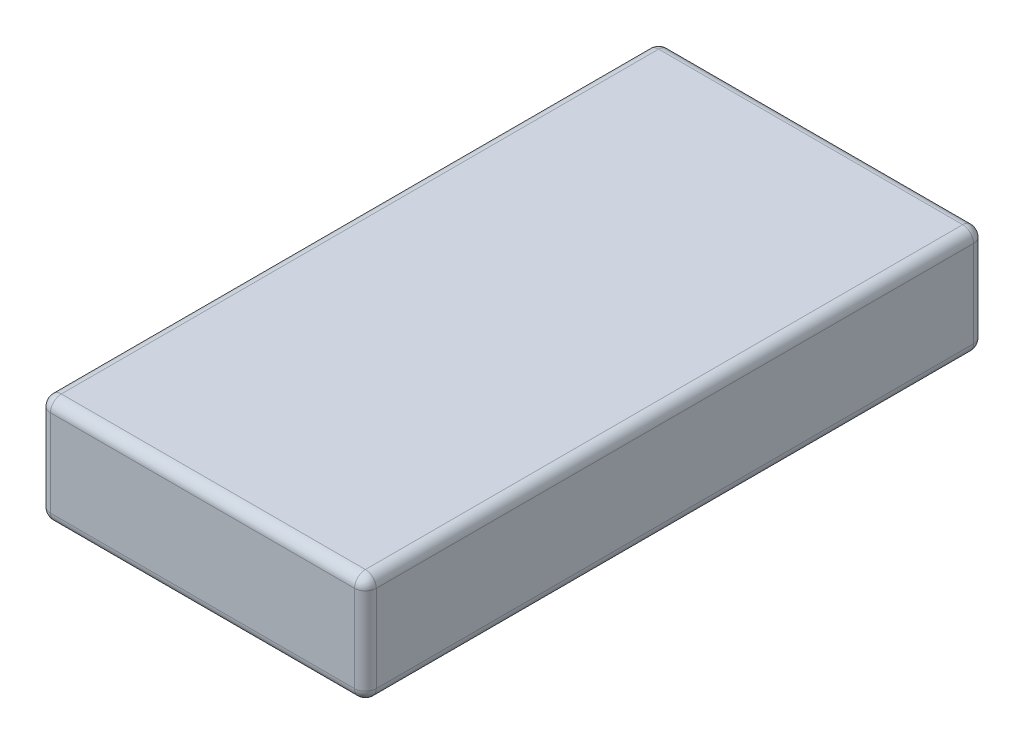
ISO-10303-21;
HEADER;
FILE_DESCRIPTION(('STEP AP214'),'2;1');
FILE_NAME('part.step','',(''),(''),'','','');
FILE_SCHEMA(('AUTOMOTIVE_DESIGN { 1 0 10303 214 1 1 1 1 }'));
ENDSEC;
DATA;
#1=APPLICATION_CONTEXT('core data for automotive mechanical design processes');
#2=APPLICATION_PROTOCOL_DEFINITION('international standard','automotive_design',2000,#1);
#3=PRODUCT_CONTEXT('',#1,'mechanical');
#4=PRODUCT('Part','Part','',(#3));
#5=PRODUCT_RELATED_PRODUCT_CATEGORY('part','',(#4));
#6=PRODUCT_DEFINITION_FORMATION('','',#4);
#7=PRODUCT_DEFINITION_CONTEXT('part definition',#1,'design');
#8=PRODUCT_DEFINITION('design','',#6,#7);
#9=PRODUCT_DEFINITION_SHAPE('','',#8);
#10=(LENGTH_UNIT() NAMED_UNIT(*) SI_UNIT(.MILLI.,.METRE.));
#11=(NAMED_UNIT(*) PLANE_ANGLE_UNIT() SI_UNIT($,.RADIAN.));
#12=(NAMED_UNIT(*) SI_UNIT($,.STERADIAN.) SOLID_ANGLE_UNIT());
#13=UNCERTAINTY_MEASURE_WITH_UNIT(LENGTH_MEASURE(1.E-05),#10,'distance_accuracy_value','');
#14=(GEOMETRIC_REPRESENTATION_CONTEXT(3) GLOBAL_UNCERTAINTY_ASSIGNED_CONTEXT((#13)) GLOBAL_UNIT_ASSIGNED_CONTEXT((#10,
#11,#12)) REPRESENTATION_CONTEXT('',''));
#15=CARTESIAN_POINT('',(0.,0.,0.));
#16=DIRECTION('',(0.,0.,1.));
#17=DIRECTION('',(1.,0.,0.));
#18=AXIS2_PLACEMENT_3D('',#15,#16,#17);
#19=CARTESIAN_POINT('',(15.,5.,57.));
#20=DIRECTION('',(-1.,0.,0.));
#21=DIRECTION('',(0.,-1.,0.));
#22=AXIS2_PLACEMENT_3D('',#19,#20,#21);
#23=PLANE('',#22);
#24=DIRECTION('',(0.,0.,-1.));
#25=VECTOR('',#24,1.);
#26=CARTESIAN_POINT('',(15.,-4.,57.));
#27=LINE('',#26,#25);
#28=CARTESIAN_POINT('',(15.,-4.,56.));
#29=VERTEX_POINT('',#28);
#30=CARTESIAN_POINT('',(15.,-4.,1.));
#31=VERTEX_POINT('',#30);
#32=EDGE_CURVE('E183',#29,#31,#27,.T.);
#33=ORIENTED_EDGE('',*,*,#32,.T.);
#34=DIRECTION('',(0.,1.,0.));
#35=VECTOR('',#34,1.);
#36=CARTESIAN_POINT('',(15.,5.,1.));
#37=LINE('',#36,#35);
#38=CARTESIAN_POINT('',(15.,4.,1.));
#39=VERTEX_POINT('',#38);
#40=EDGE_CURVE('E187',#31,#39,#37,.T.);
#41=ORIENTED_EDGE('',*,*,#40,.T.);
#42=DIRECTION('',(0.,0.,-1.));
#43=VECTOR('',#42,1.);
#44=CARTESIAN_POINT('',(15.,4.,57.));
#45=LINE('',#44,#43);
#46=CARTESIAN_POINT('',(15.,4.,56.));
#47=VERTEX_POINT('',#46);
#48=EDGE_CURVE('E185',#39,#47,#45,.F.);
#49=ORIENTED_EDGE('',*,*,#48,.T.);
#50=DIRECTION('',(0.,1.,0.));
#51=VECTOR('',#50,1.);
#52=CARTESIAN_POINT('',(15.,-5.,56.));
#53=LINE('',#52,#51);
#54=EDGE_CURVE('E181',#47,#29,#53,.F.);
#55=ORIENTED_EDGE('',*,*,#54,.T.);
#56=EDGE_LOOP('',(#33,#41,#49,#55));
#57=FACE_BOUND('',#56,.T.);
#58=ADVANCED_FACE('F35',(#57),#23,.F.);
#59=CARTESIAN_POINT('',(-15.,5.,57.));
#60=DIRECTION('',(0.,-1.,0.));
#61=DIRECTION('',(0.,0.,-1.));
#62=AXIS2_PLACEMENT_3D('',#59,#60,#61);
#63=PLANE('',#62);
#64=DIRECTION('',(-1.,0.,0.));
#65=VECTOR('',#64,1.);
#66=CARTESIAN_POINT('',(-15.,5.,1.));
#67=LINE('',#66,#65);
#68=CARTESIAN_POINT('',(14.,5.,1.));
#69=VERTEX_POINT('',#68);
#70=CARTESIAN_POINT('',(-14.,5.,1.));
#71=VERTEX_POINT('',#70);
#72=EDGE_CURVE('E169',#69,#71,#67,.T.);
#73=ORIENTED_EDGE('',*,*,#72,.T.);
#74=DIRECTION('',(0.,0.,-1.));
#75=VECTOR('',#74,1.);
#76=CARTESIAN_POINT('',(-14.,5.,57.));
#77=LINE('',#76,#75);
#78=CARTESIAN_POINT('',(-14.,5.,56.));
#79=VERTEX_POINT('',#78);
#80=EDGE_CURVE('E134',#71,#79,#77,.F.);
#81=ORIENTED_EDGE('',*,*,#80,.T.);
#82=DIRECTION('',(-1.,0.,0.));
#83=VECTOR('',#82,1.);
#84=CARTESIAN_POINT('',(15.,5.,56.));
#85=LINE('',#84,#83);
#86=CARTESIAN_POINT('',(14.,5.,56.));
#87=VERTEX_POINT('',#86);
#88=EDGE_CURVE('E161',#79,#87,#85,.F.);
#89=ORIENTED_EDGE('',*,*,#88,.T.);
#90=DIRECTION('',(0.,0.,-1.));
#91=VECTOR('',#90,1.);
#92=CARTESIAN_POINT('',(14.,5.,57.));
#93=LINE('',#92,#91);
#94=EDGE_CURVE('E163',#87,#69,#93,.T.);
#95=ORIENTED_EDGE('',*,*,#94,.T.);
#96=EDGE_LOOP('',(#73,#81,#89,#95));
#97=FACE_BOUND('',#96,.T.);
#98=ADVANCED_FACE('F317',(#97),#63,.F.);
#99=CARTESIAN_POINT('',(-15.,5.,57.));
#100=DIRECTION('',(1.,0.,0.));
#101=DIRECTION('',(0.,0.,-1.));
#102=AXIS2_PLACEMENT_3D('',#99,#100,#101);
#103=PLANE('',#102);
#104=DIRECTION('',(0.,-1.,0.));
#105=VECTOR('',#104,1.);
#106=CARTESIAN_POINT('',(-15.,5.,56.));
#107=LINE('',#106,#105);
#108=CARTESIAN_POINT('',(-15.,-4.,56.));
#109=VERTEX_POINT('',#108);
#110=CARTESIAN_POINT('',(-15.,4.,56.));
#111=VERTEX_POINT('',#110);
#112=EDGE_CURVE('E159',#109,#111,#107,.F.);
#113=ORIENTED_EDGE('',*,*,#112,.T.);
#114=DIRECTION('',(0.,0.,-1.));
#115=VECTOR('',#114,1.);
#116=CARTESIAN_POINT('',(-15.,4.,57.));
#117=LINE('',#116,#115);
#118=CARTESIAN_POINT('',(-15.,4.,1.));
#119=VERTEX_POINT('',#118);
#120=EDGE_CURVE('E132',#111,#119,#117,.T.);
#121=ORIENTED_EDGE('',*,*,#120,.T.);
#122=DIRECTION('',(0.,-1.,0.));
#123=VECTOR('',#122,1.);
#124=CARTESIAN_POINT('',(-15.,5.,1.));
#125=LINE('',#124,#123);
#126=CARTESIAN_POINT('',(-15.,-4.,1.));
#127=VERTEX_POINT('',#126);
#128=EDGE_CURVE('E150',#119,#127,#125,.T.);
#129=ORIENTED_EDGE('',*,*,#128,.T.);
#130=DIRECTION('',(0.,0.,-1.));
#131=VECTOR('',#130,1.);
#132=CARTESIAN_POINT('',(-15.,-4.,57.));
#133=LINE('',#132,#131);
#134=EDGE_CURVE('E155',#127,#109,#133,.F.);
#135=ORIENTED_EDGE('',*,*,#134,.T.);
#136=EDGE_LOOP('',(#113,#121,#129,#135));
#137=FACE_BOUND('',#136,.T.);
#138=ADVANCED_FACE('F157',(#137),#103,.F.);
#139=CARTESIAN_POINT('',(-15.,-5.,57.));
#140=DIRECTION('',(0.,1.,0.));
#141=DIRECTION('',(0.,0.,1.));
#142=AXIS2_PLACEMENT_3D('',#139,#140,#141);
#143=PLANE('',#142);
#144=DIRECTION('',(1.,0.,0.));
#145=VECTOR('',#144,1.);
#146=CARTESIAN_POINT('',(-15.,-5.,56.));
#147=LINE('',#146,#145);
#148=CARTESIAN_POINT('',(14.,-5.,56.));
#149=VERTEX_POINT('',#148);
#150=CARTESIAN_POINT('',(-14.,-5.,56.));
#151=VERTEX_POINT('',#150);
#152=EDGE_CURVE('E199',#149,#151,#147,.F.);
#153=ORIENTED_EDGE('',*,*,#152,.T.);
#154=DIRECTION('',(0.,0.,-1.));
#155=VECTOR('',#154,1.);
#156=CARTESIAN_POINT('',(-14.,-5.,57.));
#157=LINE('',#156,#155);
#158=CARTESIAN_POINT('',(-14.,-5.,1.));
#159=VERTEX_POINT('',#158);
#160=EDGE_CURVE('E11',#151,#159,#157,.T.);
#161=ORIENTED_EDGE('',*,*,#160,.T.);
#162=DIRECTION('',(1.,0.,0.));
#163=VECTOR('',#162,1.);
#164=CARTESIAN_POINT('',(-15.,-5.,1.));
#165=LINE('',#164,#163);
#166=CARTESIAN_POINT('',(14.,-5.,1.));
#167=VERTEX_POINT('',#166);
#168=EDGE_CURVE('E44',#159,#167,#165,.T.);
#169=ORIENTED_EDGE('',*,*,#168,.T.);
#170=DIRECTION('',(0.,0.,-1.));
#171=VECTOR('',#170,1.);
#172=CARTESIAN_POINT('',(14.,-5.,57.));
#173=LINE('',#172,#171);
#174=EDGE_CURVE('E201',#167,#149,#173,.F.);
#175=ORIENTED_EDGE('',*,*,#174,.T.);
#176=EDGE_LOOP('',(#153,#161,#169,#175));
#177=FACE_BOUND('',#176,.T.);
#178=ADVANCED_FACE('F282',(#177),#143,.F.);
#179=CARTESIAN_POINT('',(0.,0.,57.));
#180=DIRECTION('',(0.,0.,1.));
#181=DIRECTION('',(1.,0.,0.));
#182=AXIS2_PLACEMENT_3D('',#179,#180,#181);
#183=PLANE('',#182);
#184=DIRECTION('',(-1.,0.,0.));
#185=VECTOR('',#184,1.);
#186=CARTESIAN_POINT('',(-15.,4.,57.));
#187=LINE('',#186,#185);
#188=CARTESIAN_POINT('',(14.,4.,57.));
#189=VERTEX_POINT('',#188);
#190=CARTESIAN_POINT('',(-14.,4.,57.));
#191=VERTEX_POINT('',#190);
#192=EDGE_CURVE('E174',#189,#191,#187,.T.);
#193=ORIENTED_EDGE('',*,*,#192,.T.);
#194=DIRECTION('',(0.,-1.,0.));
#195=VECTOR('',#194,1.);
#196=CARTESIAN_POINT('',(-14.,-5.,57.));
#197=LINE('',#196,#195);
#198=CARTESIAN_POINT('',(-14.,-4.,57.));
#199=VERTEX_POINT('',#198);
#200=EDGE_CURVE('E178',#191,#199,#197,.T.);
#201=ORIENTED_EDGE('',*,*,#200,.T.);
#202=DIRECTION('',(1.,0.,0.));
#203=VECTOR('',#202,1.);
#204=CARTESIAN_POINT('',(15.,-4.,57.));
#205=LINE('',#204,#203);
#206=CARTESIAN_POINT('',(14.,-4.,57.));
#207=VERTEX_POINT('',#206);
#208=EDGE_CURVE('E176',#199,#207,#205,.T.);
#209=ORIENTED_EDGE('',*,*,#208,.T.);
#210=DIRECTION('',(0.,1.,0.));
#211=VECTOR('',#210,1.);
#212=CARTESIAN_POINT('',(14.,5.,57.));
#213=LINE('',#212,#211);
#214=EDGE_CURVE('E172',#207,#189,#213,.T.);
#215=ORIENTED_EDGE('',*,*,#214,.T.);
#216=EDGE_LOOP('',(#193,#201,#209,#215));
#217=FACE_BOUND('',#216,.T.);
#218=ADVANCED_FACE('F274',(#217),#183,.T.);
#219=CARTESIAN_POINT('',(0.,0.,0.));
#220=DIRECTION('',(0.,0.,1.));
#221=DIRECTION('',(1.,0.,0.));
#222=AXIS2_PLACEMENT_3D('',#219,#220,#221);
#223=PLANE('',#222);
#224=DIRECTION('',(-1.,0.,0.));
#225=VECTOR('',#224,1.);
#226=CARTESIAN_POINT('',(0.,4.,0.));
#227=LINE('',#226,#225);
#228=CARTESIAN_POINT('',(-14.,4.,0.));
#229=VERTEX_POINT('',#228);
#230=CARTESIAN_POINT('',(14.,4.,0.));
#231=VERTEX_POINT('',#230);
#232=EDGE_CURVE('E194',#229,#231,#227,.F.);
#233=ORIENTED_EDGE('',*,*,#232,.T.);
#234=DIRECTION('',(0.,1.,0.));
#235=VECTOR('',#234,1.);
#236=CARTESIAN_POINT('',(14.,0.,0.));
#237=LINE('',#236,#235);
#238=CARTESIAN_POINT('',(14.,-4.,0.));
#239=VERTEX_POINT('',#238);
#240=EDGE_CURVE('E196',#231,#239,#237,.F.);
#241=ORIENTED_EDGE('',*,*,#240,.T.);
#242=DIRECTION('',(1.,0.,0.));
#243=VECTOR('',#242,1.);
#244=CARTESIAN_POINT('',(0.,-4.,0.));
#245=LINE('',#244,#243);
#246=CARTESIAN_POINT('',(-14.,-4.,0.));
#247=VERTEX_POINT('',#246);
#248=EDGE_CURVE('E192',#239,#247,#245,.F.);
#249=ORIENTED_EDGE('',*,*,#248,.T.);
#250=DIRECTION('',(0.,-1.,0.));
#251=VECTOR('',#250,1.);
#252=CARTESIAN_POINT('',(-14.,0.,0.));
#253=LINE('',#252,#251);
#254=EDGE_CURVE('E190',#247,#229,#253,.F.);
#255=ORIENTED_EDGE('',*,*,#254,.T.);
#256=EDGE_LOOP('',(#233,#241,#249,#255));
#257=FACE_BOUND('',#256,.T.);
#258=ADVANCED_FACE('F296',(#257),#223,.F.);
#259=CARTESIAN_POINT('',(14.,-4.,57.));
#260=DIRECTION('',(0.,0.,-1.));
#261=DIRECTION('',(-1.,0.,0.));
#262=AXIS2_PLACEMENT_3D('',#259,#260,#261);
#263=CYLINDRICAL_SURFACE('',#262,1.);
#264=CARTESIAN_POINT('',(14.,-4.,56.));
#265=DIRECTION('',(0.,0.,1.));
#266=DIRECTION('',(1.,0.,0.));
#267=AXIS2_PLACEMENT_3D('',#264,#265,#266);
#268=CIRCLE('',#267,1.);
#269=EDGE_CURVE('E39',#149,#29,#268,.T.);
#270=ORIENTED_EDGE('',*,*,#269,.F.);
#271=ORIENTED_EDGE('',*,*,#174,.F.);
#272=CARTESIAN_POINT('',(14.,-4.,1.));
#273=DIRECTION('',(0.,0.,-1.));
#274=DIRECTION('',(-1.,0.,0.));
#275=AXIS2_PLACEMENT_3D('',#272,#273,#274);
#276=CIRCLE('',#275,1.);
#277=EDGE_CURVE('E251',#31,#167,#276,.T.);
#278=ORIENTED_EDGE('',*,*,#277,.F.);
#279=ORIENTED_EDGE('',*,*,#32,.F.);
#280=EDGE_LOOP('',(#270,#271,#278,#279));
#281=FACE_BOUND('',#280,.T.);
#282=ADVANCED_FACE('F37',(#281),#263,.T.);
#283=CARTESIAN_POINT('',(14.,-4.,56.));
#284=DIRECTION('',(0.,0.,1.));
#285=DIRECTION('',(1.,0.,0.));
#286=AXIS2_PLACEMENT_3D('',#283,#284,#285);
#287=SPHERICAL_SURFACE('',#286,1.);
#288=CARTESIAN_POINT('',(14.,-4.,56.));
#289=DIRECTION('',(1.,0.,0.));
#290=DIRECTION('',(0.,0.,-1.));
#291=AXIS2_PLACEMENT_3D('',#288,#289,#290);
#292=CIRCLE('',#291,1.);
#293=EDGE_CURVE('E246',#149,#207,#292,.F.);
#294=ORIENTED_EDGE('',*,*,#293,.F.);
#295=ORIENTED_EDGE('',*,*,#269,.T.);
#296=CARTESIAN_POINT('',(14.,-4.,56.));
#297=DIRECTION('',(0.,-1.,0.));
#298=DIRECTION('',(0.,0.,-1.));
#299=AXIS2_PLACEMENT_3D('',#296,#297,#298);
#300=CIRCLE('',#299,1.);
#301=EDGE_CURVE('E249',#207,#29,#300,.F.);
#302=ORIENTED_EDGE('',*,*,#301,.F.);
#303=EDGE_LOOP('',(#294,#295,#302));
#304=FACE_BOUND('',#303,.T.);
#305=ADVANCED_FACE('F262',(#304),#287,.T.);
#306=CARTESIAN_POINT('',(14.,-4.,1.));
#307=DIRECTION('',(0.,0.,1.));
#308=DIRECTION('',(1.,0.,0.));
#309=AXIS2_PLACEMENT_3D('',#306,#307,#308);
#310=SPHERICAL_SURFACE('',#309,1.);
#311=CARTESIAN_POINT('',(14.,-4.,1.));
#312=DIRECTION('',(0.,-1.,0.));
#313=DIRECTION('',(1.,0.,0.));
#314=AXIS2_PLACEMENT_3D('',#311,#312,#313);
#315=CIRCLE('',#314,1.);
#316=EDGE_CURVE('E240',#31,#239,#315,.F.);
#317=ORIENTED_EDGE('',*,*,#316,.F.);
#318=ORIENTED_EDGE('',*,*,#277,.T.);
#319=CARTESIAN_POINT('',(14.,-4.,1.));
#320=DIRECTION('',(1.,0.,0.));
#321=DIRECTION('',(0.,0.,-1.));
#322=AXIS2_PLACEMENT_3D('',#319,#320,#321);
#323=CIRCLE('',#322,1.);
#324=EDGE_CURVE('E243',#239,#167,#323,.F.);
#325=ORIENTED_EDGE('',*,*,#324,.F.);
#326=EDGE_LOOP('',(#317,#318,#325));
#327=FACE_BOUND('',#326,.T.);
#328=ADVANCED_FACE('F289',(#327),#310,.T.);
#329=CARTESIAN_POINT('',(14.,0.,56.));
#330=DIRECTION('',(0.,-1.,0.));
#331=DIRECTION('',(1.,0.,0.));
#332=AXIS2_PLACEMENT_3D('',#329,#330,#331);
#333=CYLINDRICAL_SURFACE('',#332,1.);
#334=ORIENTED_EDGE('',*,*,#301,.T.);
#335=ORIENTED_EDGE('',*,*,#54,.F.);
#336=CARTESIAN_POINT('',(14.,4.,56.));
#337=DIRECTION('',(0.,1.,0.));
#338=DIRECTION('',(0.,0.,1.));
#339=AXIS2_PLACEMENT_3D('',#336,#337,#338);
#340=CIRCLE('',#339,1.);
#341=EDGE_CURVE('E234',#189,#47,#340,.T.);
#342=ORIENTED_EDGE('',*,*,#341,.F.);
#343=ORIENTED_EDGE('',*,*,#214,.F.);
#344=EDGE_LOOP('',(#334,#335,#342,#343));
#345=FACE_BOUND('',#344,.T.);
#346=ADVANCED_FACE('F269',(#345),#333,.T.);
#347=CARTESIAN_POINT('',(0.,-4.,56.));
#348=DIRECTION('',(-1.,0.,0.));
#349=DIRECTION('',(0.,0.,1.));
#350=AXIS2_PLACEMENT_3D('',#347,#348,#349);
#351=CYLINDRICAL_SURFACE('',#350,1.);
#352=ORIENTED_EDGE('',*,*,#293,.T.);
#353=ORIENTED_EDGE('',*,*,#208,.F.);
#354=CARTESIAN_POINT('',(-14.,-4.,56.));
#355=DIRECTION('',(-1.,0.,0.));
#356=DIRECTION('',(0.,0.,1.));
#357=AXIS2_PLACEMENT_3D('',#354,#355,#356);
#358=CIRCLE('',#357,1.);
#359=EDGE_CURVE('E231',#151,#199,#358,.T.);
#360=ORIENTED_EDGE('',*,*,#359,.F.);
#361=ORIENTED_EDGE('',*,*,#152,.F.);
#362=EDGE_LOOP('',(#352,#353,#360,#361));
#363=FACE_BOUND('',#362,.T.);
#364=ADVANCED_FACE('F280',(#363),#351,.T.);
#365=CARTESIAN_POINT('',(-14.,-4.,57.));
#366=DIRECTION('',(0.,0.,-1.));
#367=DIRECTION('',(-1.,0.,0.));
#368=AXIS2_PLACEMENT_3D('',#365,#366,#367);
#369=CYLINDRICAL_SURFACE('',#368,1.);
#370=CARTESIAN_POINT('',(-14.,-4.,1.));
#371=DIRECTION('',(0.,0.,-1.));
#372=DIRECTION('',(-1.,0.,0.));
#373=AXIS2_PLACEMENT_3D('',#370,#371,#372);
#374=CIRCLE('',#373,1.);
#375=EDGE_CURVE('E226',#159,#127,#374,.T.);
#376=ORIENTED_EDGE('',*,*,#375,.F.);
#377=ORIENTED_EDGE('',*,*,#160,.F.);
#378=CARTESIAN_POINT('',(-14.,-4.,56.));
#379=DIRECTION('',(0.,0.,1.));
#380=DIRECTION('',(1.,0.,0.));
#381=AXIS2_PLACEMENT_3D('',#378,#379,#380);
#382=CIRCLE('',#381,1.);
#383=EDGE_CURVE('E228',#109,#151,#382,.T.);
#384=ORIENTED_EDGE('',*,*,#383,.F.);
#385=ORIENTED_EDGE('',*,*,#134,.F.);
#386=EDGE_LOOP('',(#376,#377,#384,#385));
#387=FACE_BOUND('',#386,.T.);
#388=ADVANCED_FACE('F285',(#387),#369,.T.);
#389=CARTESIAN_POINT('',(-15.,-4.,1.));
#390=DIRECTION('',(1.,0.,0.));
#391=DIRECTION('',(0.,0.,-1.));
#392=AXIS2_PLACEMENT_3D('',#389,#390,#391);
#393=CYLINDRICAL_SURFACE('',#392,1.);
#394=ORIENTED_EDGE('',*,*,#324,.T.);
#395=ORIENTED_EDGE('',*,*,#168,.F.);
#396=CARTESIAN_POINT('',(-14.,-4.,1.));
#397=DIRECTION('',(-1.,0.,0.));
#398=DIRECTION('',(0.,0.,1.));
#399=AXIS2_PLACEMENT_3D('',#396,#397,#398);
#400=CIRCLE('',#399,1.);
#401=EDGE_CURVE('E52',#247,#159,#400,.T.);
#402=ORIENTED_EDGE('',*,*,#401,.F.);
#403=ORIENTED_EDGE('',*,*,#248,.F.);
#404=EDGE_LOOP('',(#394,#395,#402,#403));
#405=FACE_BOUND('',#404,.T.);
#406=ADVANCED_FACE('F288',(#405),#393,.T.);
#407=CARTESIAN_POINT('',(14.,5.,1.));
#408=DIRECTION('',(0.,1.,0.));
#409=DIRECTION('',(-1.,0.,0.));
#410=AXIS2_PLACEMENT_3D('',#407,#408,#409);
#411=CYLINDRICAL_SURFACE('',#410,1.);
#412=ORIENTED_EDGE('',*,*,#316,.T.);
#413=ORIENTED_EDGE('',*,*,#240,.F.);
#414=CARTESIAN_POINT('',(14.,4.,1.));
#415=DIRECTION('',(0.,1.,0.));
#416=DIRECTION('',(0.,0.,1.));
#417=AXIS2_PLACEMENT_3D('',#414,#415,#416);
#418=CIRCLE('',#417,1.);
#419=EDGE_CURVE('E222',#39,#231,#418,.T.);
#420=ORIENTED_EDGE('',*,*,#419,.F.);
#421=ORIENTED_EDGE('',*,*,#40,.F.);
#422=EDGE_LOOP('',(#412,#413,#420,#421));
#423=FACE_BOUND('',#422,.T.);
#424=ADVANCED_FACE('F293',(#423),#411,.T.);
#425=CARTESIAN_POINT('',(14.,4.,57.));
#426=DIRECTION('',(0.,0.,-1.));
#427=DIRECTION('',(-1.,0.,0.));
#428=AXIS2_PLACEMENT_3D('',#425,#426,#427);
#429=CYLINDRICAL_SURFACE('',#428,1.);
#430=CARTESIAN_POINT('',(14.,4.,56.));
#431=DIRECTION('',(0.,0.,1.));
#432=DIRECTION('',(1.,0.,0.));
#433=AXIS2_PLACEMENT_3D('',#430,#431,#432);
#434=CIRCLE('',#433,1.);
#435=EDGE_CURVE('E237',#47,#87,#434,.T.);
#436=ORIENTED_EDGE('',*,*,#435,.F.);
#437=ORIENTED_EDGE('',*,*,#48,.F.);
#438=CARTESIAN_POINT('',(14.,4.,1.));
#439=DIRECTION('',(0.,0.,-1.));
#440=DIRECTION('',(-1.,0.,0.));
#441=AXIS2_PLACEMENT_3D('',#438,#439,#440);
#442=CIRCLE('',#441,1.);
#443=EDGE_CURVE('E220',#69,#39,#442,.T.);
#444=ORIENTED_EDGE('',*,*,#443,.F.);
#445=ORIENTED_EDGE('',*,*,#94,.F.);
#446=EDGE_LOOP('',(#436,#437,#444,#445));
#447=FACE_BOUND('',#446,.T.);
#448=ADVANCED_FACE('F307',(#447),#429,.T.);
#449=CARTESIAN_POINT('',(14.,4.,56.));
#450=DIRECTION('',(0.,0.,1.));
#451=DIRECTION('',(1.,0.,0.));
#452=AXIS2_PLACEMENT_3D('',#449,#450,#451);
#453=SPHERICAL_SURFACE('',#452,1.);
#454=ORIENTED_EDGE('',*,*,#341,.T.);
#455=ORIENTED_EDGE('',*,*,#435,.T.);
#456=CARTESIAN_POINT('',(14.,4.,56.));
#457=DIRECTION('',(1.,0.,0.));
#458=DIRECTION('',(0.,0.,-1.));
#459=AXIS2_PLACEMENT_3D('',#456,#457,#458);
#460=CIRCLE('',#459,1.);
#461=EDGE_CURVE('E217',#189,#87,#460,.F.);
#462=ORIENTED_EDGE('',*,*,#461,.F.);
#463=EDGE_LOOP('',(#454,#455,#462));
#464=FACE_BOUND('',#463,.T.);
#465=ADVANCED_FACE('F354',(#464),#453,.T.);
#466=CARTESIAN_POINT('',(-14.,-4.,56.));
#467=DIRECTION('',(0.,0.,1.));
#468=DIRECTION('',(1.,0.,0.));
#469=AXIS2_PLACEMENT_3D('',#466,#467,#468);
#470=SPHERICAL_SURFACE('',#469,1.);
#471=ORIENTED_EDGE('',*,*,#383,.T.);
#472=ORIENTED_EDGE('',*,*,#359,.T.);
#473=CARTESIAN_POINT('',(-14.,-4.,56.));
#474=DIRECTION('',(0.,-1.,0.));
#475=DIRECTION('',(0.,0.,-1.));
#476=AXIS2_PLACEMENT_3D('',#473,#474,#475);
#477=CIRCLE('',#476,1.);
#478=EDGE_CURVE('E215',#109,#199,#477,.F.);
#479=ORIENTED_EDGE('',*,*,#478,.F.);
#480=EDGE_LOOP('',(#471,#472,#479));
#481=FACE_BOUND('',#480,.T.);
#482=ADVANCED_FACE('F351',(#481),#470,.T.);
#483=CARTESIAN_POINT('',(-14.,-4.,1.));
#484=DIRECTION('',(0.,0.,1.));
#485=DIRECTION('',(1.,0.,0.));
#486=AXIS2_PLACEMENT_3D('',#483,#484,#485);
#487=SPHERICAL_SURFACE('',#486,1.);
#488=ORIENTED_EDGE('',*,*,#401,.T.);
#489=ORIENTED_EDGE('',*,*,#375,.T.);
#490=CARTESIAN_POINT('',(-14.,-4.,1.));
#491=DIRECTION('',(0.,-1.,0.));
#492=DIRECTION('',(0.,0.,-1.));
#493=AXIS2_PLACEMENT_3D('',#490,#491,#492);
#494=CIRCLE('',#493,1.);
#495=EDGE_CURVE('E152',#247,#127,#494,.F.);
#496=ORIENTED_EDGE('',*,*,#495,.F.);
#497=EDGE_LOOP('',(#488,#489,#496));
#498=FACE_BOUND('',#497,.T.);
#499=ADVANCED_FACE('F348',(#498),#487,.T.);
#500=CARTESIAN_POINT('',(14.,4.,1.));
#501=DIRECTION('',(0.,0.,1.));
#502=DIRECTION('',(1.,0.,0.));
#503=AXIS2_PLACEMENT_3D('',#500,#501,#502);
#504=SPHERICAL_SURFACE('',#503,1.);
#505=ORIENTED_EDGE('',*,*,#443,.T.);
#506=ORIENTED_EDGE('',*,*,#419,.T.);
#507=CARTESIAN_POINT('',(14.,4.,1.));
#508=DIRECTION('',(1.,0.,0.));
#509=DIRECTION('',(0.,1.,0.));
#510=AXIS2_PLACEMENT_3D('',#507,#508,#509);
#511=CIRCLE('',#510,1.);
#512=EDGE_CURVE('E211',#69,#231,#511,.F.);
#513=ORIENTED_EDGE('',*,*,#512,.F.);
#514=EDGE_LOOP('',(#505,#506,#513));
#515=FACE_BOUND('',#514,.T.);
#516=ADVANCED_FACE('F303',(#515),#504,.T.);
#517=CARTESIAN_POINT('',(0.,4.,56.));
#518=DIRECTION('',(1.,0.,0.));
#519=DIRECTION('',(0.,0.,-1.));
#520=AXIS2_PLACEMENT_3D('',#517,#518,#519);
#521=CYLINDRICAL_SURFACE('',#520,1.);
#522=ORIENTED_EDGE('',*,*,#461,.T.);
#523=ORIENTED_EDGE('',*,*,#88,.F.);
#524=CARTESIAN_POINT('',(-14.,4.,56.));
#525=DIRECTION('',(-1.,0.,0.));
#526=DIRECTION('',(0.,0.,1.));
#527=AXIS2_PLACEMENT_3D('',#524,#525,#526);
#528=CIRCLE('',#527,1.);
#529=EDGE_CURVE('E208',#191,#79,#528,.T.);
#530=ORIENTED_EDGE('',*,*,#529,.F.);
#531=ORIENTED_EDGE('',*,*,#192,.F.);
#532=EDGE_LOOP('',(#522,#523,#530,#531));
#533=FACE_BOUND('',#532,.T.);
#534=ADVANCED_FACE('F341',(#533),#521,.T.);
#535=CARTESIAN_POINT('',(-14.,0.,56.));
#536=DIRECTION('',(0.,1.,0.));
#537=DIRECTION('',(0.,0.,1.));
#538=AXIS2_PLACEMENT_3D('',#535,#536,#537);
#539=CYLINDRICAL_SURFACE('',#538,1.);
#540=ORIENTED_EDGE('',*,*,#478,.T.);
#541=ORIENTED_EDGE('',*,*,#200,.F.);
#542=CARTESIAN_POINT('',(-14.,4.,56.));
#543=DIRECTION('',(0.,1.,0.));
#544=DIRECTION('',(0.,0.,1.));
#545=AXIS2_PLACEMENT_3D('',#542,#543,#544);
#546=CIRCLE('',#545,1.);
#547=EDGE_CURVE('E147',#111,#191,#546,.T.);
#548=ORIENTED_EDGE('',*,*,#547,.F.);
#549=ORIENTED_EDGE('',*,*,#112,.F.);
#550=EDGE_LOOP('',(#540,#541,#548,#549));
#551=FACE_BOUND('',#550,.T.);
#552=ADVANCED_FACE('F338',(#551),#539,.T.);
#553=CARTESIAN_POINT('',(-14.,5.,1.));
#554=DIRECTION('',(0.,-1.,0.));
#555=DIRECTION('',(0.,0.,-1.));
#556=AXIS2_PLACEMENT_3D('',#553,#554,#555);
#557=CYLINDRICAL_SURFACE('',#556,1.);
#558=ORIENTED_EDGE('',*,*,#495,.T.);
#559=ORIENTED_EDGE('',*,*,#128,.F.);
#560=CARTESIAN_POINT('',(-14.,4.,1.));
#561=DIRECTION('',(0.,1.,0.));
#562=DIRECTION('',(0.,0.,1.));
#563=AXIS2_PLACEMENT_3D('',#560,#561,#562);
#564=CIRCLE('',#563,1.);
#565=EDGE_CURVE('E140',#229,#119,#564,.T.);
#566=ORIENTED_EDGE('',*,*,#565,.F.);
#567=ORIENTED_EDGE('',*,*,#254,.F.);
#568=EDGE_LOOP('',(#558,#559,#566,#567));
#569=FACE_BOUND('',#568,.T.);
#570=ADVANCED_FACE('F151',(#569),#557,.T.);
#571=CARTESIAN_POINT('',(-15.,4.,1.));
#572=DIRECTION('',(-1.,0.,0.));
#573=DIRECTION('',(0.,0.,1.));
#574=AXIS2_PLACEMENT_3D('',#571,#572,#573);
#575=CYLINDRICAL_SURFACE('',#574,1.);
#576=ORIENTED_EDGE('',*,*,#512,.T.);
#577=ORIENTED_EDGE('',*,*,#232,.F.);
#578=CARTESIAN_POINT('',(-14.,4.,1.));
#579=DIRECTION('',(-1.,0.,0.));
#580=DIRECTION('',(0.,0.,1.));
#581=AXIS2_PLACEMENT_3D('',#578,#579,#580);
#582=CIRCLE('',#581,1.);
#583=EDGE_CURVE('E144',#71,#229,#582,.T.);
#584=ORIENTED_EDGE('',*,*,#583,.F.);
#585=ORIENTED_EDGE('',*,*,#72,.F.);
#586=EDGE_LOOP('',(#576,#577,#584,#585));
#587=FACE_BOUND('',#586,.T.);
#588=ADVANCED_FACE('F299',(#587),#575,.T.);
#589=CARTESIAN_POINT('',(-14.,4.,56.));
#590=DIRECTION('',(0.,0.,1.));
#591=DIRECTION('',(1.,0.,0.));
#592=AXIS2_PLACEMENT_3D('',#589,#590,#591);
#593=SPHERICAL_SURFACE('',#592,1.);
#594=ORIENTED_EDGE('',*,*,#547,.T.);
#595=ORIENTED_EDGE('',*,*,#529,.T.);
#596=CARTESIAN_POINT('',(-14.,4.,56.));
#597=DIRECTION('',(0.,0.,1.));
#598=DIRECTION('',(1.,0.,0.));
#599=AXIS2_PLACEMENT_3D('',#596,#597,#598);
#600=CIRCLE('',#599,1.);
#601=EDGE_CURVE('E137',#111,#79,#600,.F.);
#602=ORIENTED_EDGE('',*,*,#601,.F.);
#603=EDGE_LOOP('',(#594,#595,#602));
#604=FACE_BOUND('',#603,.T.);
#605=ADVANCED_FACE('F330',(#604),#593,.T.);
#606=CARTESIAN_POINT('',(-14.,4.,1.));
#607=DIRECTION('',(0.,0.,1.));
#608=DIRECTION('',(1.,0.,0.));
#609=AXIS2_PLACEMENT_3D('',#606,#607,#608);
#610=SPHERICAL_SURFACE('',#609,1.);
#611=ORIENTED_EDGE('',*,*,#583,.T.);
#612=ORIENTED_EDGE('',*,*,#565,.T.);
#613=CARTESIAN_POINT('',(-14.,4.,1.));
#614=DIRECTION('',(0.,0.,-1.));
#615=DIRECTION('',(-1.,0.,0.));
#616=AXIS2_PLACEMENT_3D('',#613,#614,#615);
#617=CIRCLE('',#616,1.);
#618=EDGE_CURVE('E128',#71,#119,#617,.F.);
#619=ORIENTED_EDGE('',*,*,#618,.F.);
#620=EDGE_LOOP('',(#611,#612,#619));
#621=FACE_BOUND('',#620,.T.);
#622=ADVANCED_FACE('F142',(#621),#610,.T.);
#623=CARTESIAN_POINT('',(-14.,4.,57.));
#624=DIRECTION('',(0.,0.,-1.));
#625=DIRECTION('',(-1.,0.,0.));
#626=AXIS2_PLACEMENT_3D('',#623,#624,#625);
#627=CYLINDRICAL_SURFACE('',#626,1.);
#628=ORIENTED_EDGE('',*,*,#601,.T.);
#629=ORIENTED_EDGE('',*,*,#80,.F.);
#630=ORIENTED_EDGE('',*,*,#618,.T.);
#631=ORIENTED_EDGE('',*,*,#120,.F.);
#632=EDGE_LOOP('',(#628,#629,#630,#631));
#633=FACE_BOUND('',#632,.T.);
#634=ADVANCED_FACE('F130',(#633),#627,.T.);
#635=CLOSED_SHELL('',(#58,#98,#138,#178,#218,#258,#282,#305,#328,#346,#364,#388,#406,#424,#448,
#465,#482,#499,#516,#534,#552,#570,#588,#605,#622,#634));
#636=MANIFOLD_SOLID_BREP('B2',#635);
#637=ADVANCED_BREP_SHAPE_REPRESENTATION('',(#18,#636),#14);
#638=SHAPE_DEFINITION_REPRESENTATION(#9,#637);
ENDSEC;
END-ISO-10303-21;
